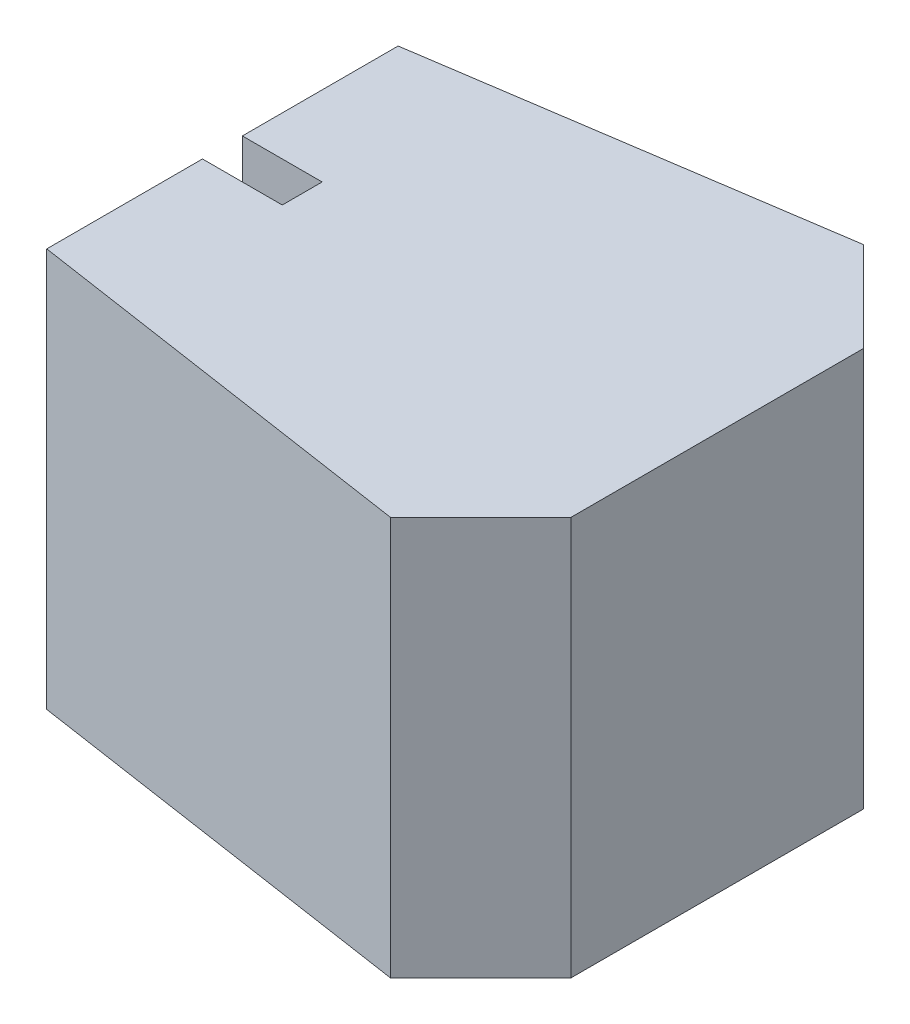
ISO-10303-21;
HEADER;
FILE_DESCRIPTION(('STEP AP214'),'2;1');
FILE_NAME('part.step','',(''),(''),'','','');
FILE_SCHEMA(('AUTOMOTIVE_DESIGN { 1 0 10303 214 1 1 1 1 }'));
ENDSEC;
DATA;
#1=APPLICATION_CONTEXT('core data for automotive mechanical design processes');
#2=APPLICATION_PROTOCOL_DEFINITION('international standard','automotive_design',2000,#1);
#3=PRODUCT_CONTEXT('',#1,'mechanical');
#4=PRODUCT('Part','Part','',(#3));
#5=PRODUCT_RELATED_PRODUCT_CATEGORY('part','',(#4));
#6=PRODUCT_DEFINITION_FORMATION('','',#4);
#7=PRODUCT_DEFINITION_CONTEXT('part definition',#1,'design');
#8=PRODUCT_DEFINITION('design','',#6,#7);
#9=PRODUCT_DEFINITION_SHAPE('','',#8);
#10=(LENGTH_UNIT() NAMED_UNIT(*) SI_UNIT(.MILLI.,.METRE.));
#11=(NAMED_UNIT(*) PLANE_ANGLE_UNIT() SI_UNIT($,.RADIAN.));
#12=(NAMED_UNIT(*) SI_UNIT($,.STERADIAN.) SOLID_ANGLE_UNIT());
#13=UNCERTAINTY_MEASURE_WITH_UNIT(LENGTH_MEASURE(1.E-05),#10,'distance_accuracy_value','');
#14=(GEOMETRIC_REPRESENTATION_CONTEXT(3) GLOBAL_UNCERTAINTY_ASSIGNED_CONTEXT((#13)) GLOBAL_UNIT_ASSIGNED_CONTEXT((#10,
#11,#12)) REPRESENTATION_CONTEXT('',''));
#15=CARTESIAN_POINT('',(0.,0.,0.));
#16=DIRECTION('',(0.,0.,1.));
#17=DIRECTION('',(1.,0.,0.));
#18=AXIS2_PLACEMENT_3D('',#15,#16,#17);
#19=CARTESIAN_POINT('',(0.,500.,25.));
#20=DIRECTION('',(0.,0.,1.));
#21=DIRECTION('',(1.,0.,0.));
#22=AXIS2_PLACEMENT_3D('',#19,#20,#21);
#23=PLANE('',#22);
#24=DIRECTION('',(-1.,0.,0.));
#25=VECTOR('',#24,1.);
#26=CARTESIAN_POINT('',(0.,0.,25.));
#27=LINE('',#26,#25);
#28=CARTESIAN_POINT('',(100.,0.,25.));
#29=VERTEX_POINT('',#28);
#30=CARTESIAN_POINT('',(0.,0.,25.));
#31=VERTEX_POINT('',#30);
#32=EDGE_CURVE('E148',#29,#31,#27,.T.);
#33=ORIENTED_EDGE('',*,*,#32,.T.);
#34=DIRECTION('',(0.,-1.,0.));
#35=VECTOR('',#34,1.);
#36=CARTESIAN_POINT('',(0.,500.,25.));
#37=LINE('',#36,#35);
#38=CARTESIAN_POINT('',(0.,500.,25.));
#39=VERTEX_POINT('',#38);
#40=EDGE_CURVE('E11',#39,#31,#37,.T.);
#41=ORIENTED_EDGE('',*,*,#40,.F.);
#42=DIRECTION('',(-1.,0.,0.));
#43=VECTOR('',#42,1.);
#44=CARTESIAN_POINT('',(0.,500.,25.));
#45=LINE('',#44,#43);
#46=CARTESIAN_POINT('',(100.,500.,25.));
#47=VERTEX_POINT('',#46);
#48=EDGE_CURVE('E172',#47,#39,#45,.T.);
#49=ORIENTED_EDGE('',*,*,#48,.F.);
#50=DIRECTION('',(0.,-1.,0.));
#51=VECTOR('',#50,1.);
#52=CARTESIAN_POINT('',(100.,500.,25.));
#53=LINE('',#52,#51);
#54=EDGE_CURVE('E56',#47,#29,#53,.T.);
#55=ORIENTED_EDGE('',*,*,#54,.T.);
#56=EDGE_LOOP('',(#33,#41,#49,#55));
#57=FACE_BOUND('',#56,.T.);
#58=ADVANCED_FACE('F40',(#57),#23,.F.);
#59=CARTESIAN_POINT('',(0.,500.,0.));
#60=DIRECTION('',(1.,0.,0.));
#61=DIRECTION('',(0.,0.,-1.));
#62=AXIS2_PLACEMENT_3D('',#59,#60,#61);
#63=PLANE('',#62);
#64=DIRECTION('',(0.,0.,1.));
#65=VECTOR('',#64,1.);
#66=CARTESIAN_POINT('',(0.,0.,0.));
#67=LINE('',#66,#65);
#68=CARTESIAN_POINT('',(0.,0.,220.223748416157));
#69=VERTEX_POINT('',#68);
#70=EDGE_CURVE('E150',#31,#69,#67,.T.);
#71=ORIENTED_EDGE('',*,*,#70,.T.);
#72=DIRECTION('',(0.,-1.,0.));
#73=VECTOR('',#72,1.);
#74=CARTESIAN_POINT('',(0.,500.,220.223748416157));
#75=LINE('',#74,#73);
#76=CARTESIAN_POINT('',(0.,500.,220.223748416157));
#77=VERTEX_POINT('',#76);
#78=EDGE_CURVE('E48',#77,#69,#75,.T.);
#79=ORIENTED_EDGE('',*,*,#78,.F.);
#80=DIRECTION('',(0.,0.,1.));
#81=VECTOR('',#80,1.);
#82=CARTESIAN_POINT('',(0.,500.,0.));
#83=LINE('',#82,#81);
#84=EDGE_CURVE('E100',#39,#77,#83,.T.);
#85=ORIENTED_EDGE('',*,*,#84,.F.);
#86=ORIENTED_EDGE('',*,*,#40,.T.);
#87=EDGE_LOOP('',(#71,#79,#85,#86));
#88=FACE_BOUND('',#87,.T.);
#89=ADVANCED_FACE('F191',(#88),#63,.F.);
#90=CARTESIAN_POINT('',(-32.3066623593384,500.,215.377749062256));
#91=DIRECTION('',(-0.148340452930245,0.,0.988936352868298));
#92=DIRECTION('',(0.988936352868298,0.,0.148340452930245));
#93=AXIS2_PLACEMENT_3D('',#90,#91,#92);
#94=PLANE('',#93);
#95=DIRECTION('',(-0.988936352868298,0.,-0.148340452930245));
#96=VECTOR('',#95,1.);
#97=CARTESIAN_POINT('',(-32.3066623593384,0.,215.377749062256));
#98=LINE('',#97,#96);
#99=CARTESIAN_POINT('',(507.009150288092,0.,296.27512095937));
#100=VERTEX_POINT('',#99);
#101=EDGE_CURVE('E153',#100,#69,#98,.T.);
#102=ORIENTED_EDGE('',*,*,#101,.F.);
#103=DIRECTION('',(0.,-1.,0.));
#104=VECTOR('',#103,1.);
#105=CARTESIAN_POINT('',(507.009150288092,500.,296.27512095937));
#106=LINE('',#105,#104);
#107=CARTESIAN_POINT('',(507.009150288092,500.,296.27512095937));
#108=VERTEX_POINT('',#107);
#109=EDGE_CURVE('E184',#108,#100,#106,.T.);
#110=ORIENTED_EDGE('',*,*,#109,.F.);
#111=DIRECTION('',(-0.988936352868298,0.,-0.148340452930245));
#112=VECTOR('',#111,1.);
#113=CARTESIAN_POINT('',(-32.3066623593384,500.,215.377749062256));
#114=LINE('',#113,#112);
#115=EDGE_CURVE('E190',#108,#77,#114,.T.);
#116=ORIENTED_EDGE('',*,*,#115,.T.);
#117=ORIENTED_EDGE('',*,*,#78,.T.);
#118=EDGE_LOOP('',(#102,#110,#116,#117));
#119=FACE_BOUND('',#118,.T.);
#120=ADVANCED_FACE('F188',(#119),#94,.T.);
#121=CARTESIAN_POINT('',(401.642135623731,500.,401.642135623731));
#122=DIRECTION('',(0.707106781186548,0.,0.707106781186547));
#123=DIRECTION('',(0.707106781186547,0.,-0.707106781186548));
#124=AXIS2_PLACEMENT_3D('',#121,#122,#123);
#125=PLANE('',#124);
#126=DIRECTION('',(-0.707106781186547,0.,0.707106781186548));
#127=VECTOR('',#126,1.);
#128=CARTESIAN_POINT('',(401.642135623731,0.,401.642135623731));
#129=LINE('',#128,#127);
#130=CARTESIAN_POINT('',(620.,0.,183.284271247462));
#131=VERTEX_POINT('',#130);
#132=EDGE_CURVE('E156',#131,#100,#129,.T.);
#133=ORIENTED_EDGE('',*,*,#132,.F.);
#134=DIRECTION('',(0.,-1.,0.));
#135=VECTOR('',#134,1.);
#136=CARTESIAN_POINT('',(620.,500.,183.284271247462));
#137=LINE('',#136,#135);
#138=CARTESIAN_POINT('',(620.,500.,183.284271247462));
#139=VERTEX_POINT('',#138);
#140=EDGE_CURVE('E182',#139,#131,#137,.T.);
#141=ORIENTED_EDGE('',*,*,#140,.F.);
#142=DIRECTION('',(-0.707106781186547,0.,0.707106781186548));
#143=VECTOR('',#142,1.);
#144=CARTESIAN_POINT('',(401.642135623731,500.,401.642135623731));
#145=LINE('',#144,#143);
#146=EDGE_CURVE('E203',#139,#108,#145,.T.);
#147=ORIENTED_EDGE('',*,*,#146,.T.);
#148=ORIENTED_EDGE('',*,*,#109,.T.);
#149=EDGE_LOOP('',(#133,#141,#147,#148));
#150=FACE_BOUND('',#149,.T.);
#151=ADVANCED_FACE('F199',(#150),#125,.T.);
#152=CARTESIAN_POINT('',(620.,500.,0.));
#153=DIRECTION('',(-1.,0.,0.));
#154=DIRECTION('',(0.,0.,1.));
#155=AXIS2_PLACEMENT_3D('',#152,#153,#154);
#156=PLANE('',#155);
#157=DIRECTION('',(0.,0.,-1.));
#158=VECTOR('',#157,1.);
#159=CARTESIAN_POINT('',(620.,0.,0.));
#160=LINE('',#159,#158);
#161=CARTESIAN_POINT('',(620.,0.,-183.284271247462));
#162=VERTEX_POINT('',#161);
#163=EDGE_CURVE('E159',#131,#162,#160,.T.);
#164=ORIENTED_EDGE('',*,*,#163,.T.);
#165=DIRECTION('',(0.,-1.,0.));
#166=VECTOR('',#165,1.);
#167=CARTESIAN_POINT('',(620.,500.,-183.284271247462));
#168=LINE('',#167,#166);
#169=CARTESIAN_POINT('',(620.,500.,-183.284271247462));
#170=VERTEX_POINT('',#169);
#171=EDGE_CURVE('E179',#170,#162,#168,.T.);
#172=ORIENTED_EDGE('',*,*,#171,.F.);
#173=DIRECTION('',(0.,0.,-1.));
#174=VECTOR('',#173,1.);
#175=CARTESIAN_POINT('',(620.,500.,0.));
#176=LINE('',#175,#174);
#177=EDGE_CURVE('E205',#139,#170,#176,.T.);
#178=ORIENTED_EDGE('',*,*,#177,.F.);
#179=ORIENTED_EDGE('',*,*,#140,.T.);
#180=EDGE_LOOP('',(#164,#172,#178,#179));
#181=FACE_BOUND('',#180,.T.);
#182=ADVANCED_FACE('F241',(#181),#156,.F.);
#183=CARTESIAN_POINT('',(401.642135623731,500.,-401.642135623731));
#184=DIRECTION('',(-0.707106781186548,0.,0.707106781186548));
#185=DIRECTION('',(0.707106781186548,0.,0.707106781186548));
#186=AXIS2_PLACEMENT_3D('',#183,#184,#185);
#187=PLANE('',#186);
#188=DIRECTION('',(-0.707106781186548,0.,-0.707106781186548));
#189=VECTOR('',#188,1.);
#190=CARTESIAN_POINT('',(401.642135623731,0.,-401.642135623731));
#191=LINE('',#190,#189);
#192=CARTESIAN_POINT('',(507.009150288091,0.,-296.27512095937));
#193=VERTEX_POINT('',#192);
#194=EDGE_CURVE('E161',#162,#193,#191,.T.);
#195=ORIENTED_EDGE('',*,*,#194,.T.);
#196=DIRECTION('',(0.,-1.,0.));
#197=VECTOR('',#196,1.);
#198=CARTESIAN_POINT('',(507.009150288091,500.,-296.27512095937));
#199=LINE('',#198,#197);
#200=CARTESIAN_POINT('',(507.009150288091,500.,-296.27512095937));
#201=VERTEX_POINT('',#200);
#202=EDGE_CURVE('E176',#201,#193,#199,.T.);
#203=ORIENTED_EDGE('',*,*,#202,.F.);
#204=DIRECTION('',(-0.707106781186548,0.,-0.707106781186548));
#205=VECTOR('',#204,1.);
#206=CARTESIAN_POINT('',(401.642135623731,500.,-401.642135623731));
#207=LINE('',#206,#205);
#208=EDGE_CURVE('E211',#170,#201,#207,.T.);
#209=ORIENTED_EDGE('',*,*,#208,.F.);
#210=ORIENTED_EDGE('',*,*,#171,.T.);
#211=EDGE_LOOP('',(#195,#203,#209,#210));
#212=FACE_BOUND('',#211,.T.);
#213=ADVANCED_FACE('F216',(#212),#187,.F.);
#214=CARTESIAN_POINT('',(-32.3066623593384,500.,-215.377749062256));
#215=DIRECTION('',(0.148340452930245,0.,0.988936352868298));
#216=DIRECTION('',(0.988936352868298,0.,-0.148340452930245));
#217=AXIS2_PLACEMENT_3D('',#214,#215,#216);
#218=PLANE('',#217);
#219=DIRECTION('',(-0.988936352868298,0.,0.148340452930245));
#220=VECTOR('',#219,1.);
#221=CARTESIAN_POINT('',(-32.3066623593384,0.,-215.377749062256));
#222=LINE('',#221,#220);
#223=CARTESIAN_POINT('',(0.,0.,-220.223748416157));
#224=VERTEX_POINT('',#223);
#225=EDGE_CURVE('E163',#193,#224,#222,.T.);
#226=ORIENTED_EDGE('',*,*,#225,.T.);
#227=DIRECTION('',(0.,-1.,0.));
#228=VECTOR('',#227,1.);
#229=CARTESIAN_POINT('',(0.,500.,-220.223748416157));
#230=LINE('',#229,#228);
#231=CARTESIAN_POINT('',(0.,500.,-220.223748416157));
#232=VERTEX_POINT('',#231);
#233=EDGE_CURVE('E131',#232,#224,#230,.T.);
#234=ORIENTED_EDGE('',*,*,#233,.F.);
#235=DIRECTION('',(-0.988936352868298,0.,0.148340452930245));
#236=VECTOR('',#235,1.);
#237=CARTESIAN_POINT('',(-32.3066623593384,500.,-215.377749062256));
#238=LINE('',#237,#236);
#239=EDGE_CURVE('E139',#201,#232,#238,.T.);
#240=ORIENTED_EDGE('',*,*,#239,.F.);
#241=ORIENTED_EDGE('',*,*,#202,.T.);
#242=EDGE_LOOP('',(#226,#234,#240,#241));
#243=FACE_BOUND('',#242,.T.);
#244=ADVANCED_FACE('F219',(#243),#218,.F.);
#245=CARTESIAN_POINT('',(-2.22044604925031E-13,500.,0.));
#246=DIRECTION('',(-1.,0.,0.));
#247=DIRECTION('',(0.,0.,1.));
#248=AXIS2_PLACEMENT_3D('',#245,#246,#247);
#249=PLANE('',#248);
#250=DIRECTION('',(0.,0.,-1.));
#251=VECTOR('',#250,1.);
#252=CARTESIAN_POINT('',(-2.22044604925031E-13,0.,0.));
#253=LINE('',#252,#251);
#254=CARTESIAN_POINT('',(0.,0.,-25.));
#255=VERTEX_POINT('',#254);
#256=EDGE_CURVE('E127',#255,#224,#253,.T.);
#257=ORIENTED_EDGE('',*,*,#256,.F.);
#258=DIRECTION('',(0.,-1.,0.));
#259=VECTOR('',#258,1.);
#260=CARTESIAN_POINT('',(0.,500.,-25.));
#261=LINE('',#260,#259);
#262=CARTESIAN_POINT('',(0.,500.,-25.));
#263=VERTEX_POINT('',#262);
#264=EDGE_CURVE('E122',#263,#255,#261,.T.);
#265=ORIENTED_EDGE('',*,*,#264,.F.);
#266=DIRECTION('',(0.,0.,-1.));
#267=VECTOR('',#266,1.);
#268=CARTESIAN_POINT('',(-2.22044604925031E-13,500.,0.));
#269=LINE('',#268,#267);
#270=EDGE_CURVE('E125',#263,#232,#269,.T.);
#271=ORIENTED_EDGE('',*,*,#270,.T.);
#272=ORIENTED_EDGE('',*,*,#233,.T.);
#273=EDGE_LOOP('',(#257,#265,#271,#272));
#274=FACE_BOUND('',#273,.T.);
#275=ADVANCED_FACE('F124',(#274),#249,.T.);
#276=CARTESIAN_POINT('',(0.,500.,-25.));
#277=DIRECTION('',(0.,0.,1.));
#278=DIRECTION('',(1.,0.,0.));
#279=AXIS2_PLACEMENT_3D('',#276,#277,#278);
#280=PLANE('',#279);
#281=DIRECTION('',(-1.,0.,0.));
#282=VECTOR('',#281,1.);
#283=CARTESIAN_POINT('',(0.,0.,-25.));
#284=LINE('',#283,#282);
#285=CARTESIAN_POINT('',(100.,0.,-25.));
#286=VERTEX_POINT('',#285);
#287=EDGE_CURVE('E167',#286,#255,#284,.T.);
#288=ORIENTED_EDGE('',*,*,#287,.F.);
#289=DIRECTION('',(0.,-1.,0.));
#290=VECTOR('',#289,1.);
#291=CARTESIAN_POINT('',(100.,500.,-25.));
#292=LINE('',#291,#290);
#293=CARTESIAN_POINT('',(100.,500.,-25.));
#294=VERTEX_POINT('',#293);
#295=EDGE_CURVE('E88',#294,#286,#292,.T.);
#296=ORIENTED_EDGE('',*,*,#295,.F.);
#297=DIRECTION('',(-1.,0.,0.));
#298=VECTOR('',#297,1.);
#299=CARTESIAN_POINT('',(0.,500.,-25.));
#300=LINE('',#299,#298);
#301=EDGE_CURVE('E137',#294,#263,#300,.T.);
#302=ORIENTED_EDGE('',*,*,#301,.T.);
#303=ORIENTED_EDGE('',*,*,#264,.T.);
#304=EDGE_LOOP('',(#288,#296,#302,#303));
#305=FACE_BOUND('',#304,.T.);
#306=ADVANCED_FACE('F142',(#305),#280,.T.);
#307=CARTESIAN_POINT('',(100.,500.,0.));
#308=DIRECTION('',(-1.,0.,0.));
#309=DIRECTION('',(0.,0.,1.));
#310=AXIS2_PLACEMENT_3D('',#307,#308,#309);
#311=PLANE('',#310);
#312=DIRECTION('',(0.,0.,-1.));
#313=VECTOR('',#312,1.);
#314=CARTESIAN_POINT('',(100.,0.,0.));
#315=LINE('',#314,#313);
#316=EDGE_CURVE('E169',#29,#286,#315,.T.);
#317=ORIENTED_EDGE('',*,*,#316,.F.);
#318=ORIENTED_EDGE('',*,*,#54,.F.);
#319=DIRECTION('',(0.,0.,-1.));
#320=VECTOR('',#319,1.);
#321=CARTESIAN_POINT('',(100.,500.,0.));
#322=LINE('',#321,#320);
#323=EDGE_CURVE('E143',#47,#294,#322,.T.);
#324=ORIENTED_EDGE('',*,*,#323,.T.);
#325=ORIENTED_EDGE('',*,*,#295,.T.);
#326=EDGE_LOOP('',(#317,#318,#324,#325));
#327=FACE_BOUND('',#326,.T.);
#328=ADVANCED_FACE('F220',(#327),#311,.T.);
#329=CARTESIAN_POINT('',(0.,500.,0.));
#330=DIRECTION('',(0.,1.,0.));
#331=DIRECTION('',(0.,0.,1.));
#332=AXIS2_PLACEMENT_3D('',#329,#330,#331);
#333=PLANE('',#332);
#334=ORIENTED_EDGE('',*,*,#48,.T.);
#335=ORIENTED_EDGE('',*,*,#84,.T.);
#336=ORIENTED_EDGE('',*,*,#115,.F.);
#337=ORIENTED_EDGE('',*,*,#146,.F.);
#338=ORIENTED_EDGE('',*,*,#177,.T.);
#339=ORIENTED_EDGE('',*,*,#208,.T.);
#340=ORIENTED_EDGE('',*,*,#239,.T.);
#341=ORIENTED_EDGE('',*,*,#270,.F.);
#342=ORIENTED_EDGE('',*,*,#301,.F.);
#343=ORIENTED_EDGE('',*,*,#323,.F.);
#344=EDGE_LOOP('',(#334,#335,#336,#337,#338,#339,#340,#341,#342,#343));
#345=FACE_BOUND('',#344,.T.);
#346=ADVANCED_FACE('F135',(#345),#333,.T.);
#347=CARTESIAN_POINT('',(0.,0.,0.));
#348=DIRECTION('',(0.,1.,0.));
#349=DIRECTION('',(0.,0.,1.));
#350=AXIS2_PLACEMENT_3D('',#347,#348,#349);
#351=PLANE('',#350);
#352=ORIENTED_EDGE('',*,*,#32,.F.);
#353=ORIENTED_EDGE('',*,*,#316,.T.);
#354=ORIENTED_EDGE('',*,*,#287,.T.);
#355=ORIENTED_EDGE('',*,*,#256,.T.);
#356=ORIENTED_EDGE('',*,*,#225,.F.);
#357=ORIENTED_EDGE('',*,*,#194,.F.);
#358=ORIENTED_EDGE('',*,*,#163,.F.);
#359=ORIENTED_EDGE('',*,*,#132,.T.);
#360=ORIENTED_EDGE('',*,*,#101,.T.);
#361=ORIENTED_EDGE('',*,*,#70,.F.);
#362=EDGE_LOOP('',(#352,#353,#354,#355,#356,#357,#358,#359,#360,#361));
#363=FACE_BOUND('',#362,.T.);
#364=ADVANCED_FACE('F194',(#363),#351,.F.);
#365=CLOSED_SHELL('',(#58,#89,#120,#151,#182,#213,#244,#275,#306,#328,#346,#364));
#366=MANIFOLD_SOLID_BREP('B2',#365);
#367=ADVANCED_BREP_SHAPE_REPRESENTATION('',(#18,#366),#14);
#368=SHAPE_DEFINITION_REPRESENTATION(#9,#367);
ENDSEC;
END-ISO-10303-21;
